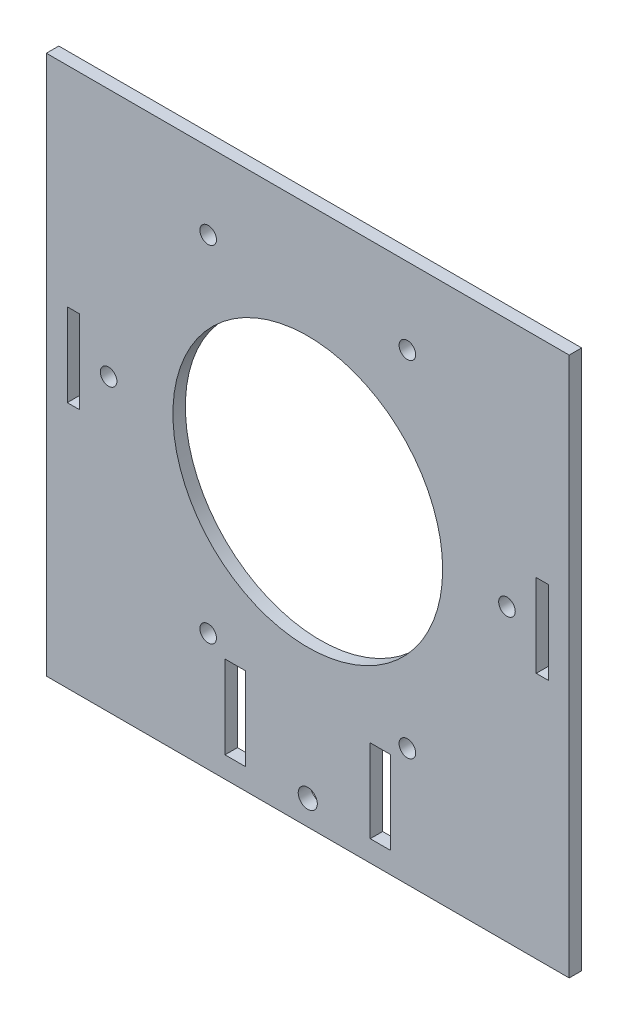
ISO-10303-21;
HEADER;
FILE_DESCRIPTION(('STEP AP214'),'2;1');
FILE_NAME('part.step','',(''),(''),'','','');
FILE_SCHEMA(('AUTOMOTIVE_DESIGN { 1 0 10303 214 1 1 1 1 }'));
ENDSEC;
DATA;
#1=APPLICATION_CONTEXT('core data for automotive mechanical design processes');
#2=APPLICATION_PROTOCOL_DEFINITION('international standard','automotive_design',2000,#1);
#3=PRODUCT_CONTEXT('',#1,'mechanical');
#4=PRODUCT('Part','Part','',(#3));
#5=PRODUCT_RELATED_PRODUCT_CATEGORY('part','',(#4));
#6=PRODUCT_DEFINITION_FORMATION('','',#4);
#7=PRODUCT_DEFINITION_CONTEXT('part definition',#1,'design');
#8=PRODUCT_DEFINITION('design','',#6,#7);
#9=PRODUCT_DEFINITION_SHAPE('','',#8);
#10=(LENGTH_UNIT() NAMED_UNIT(*) SI_UNIT(.MILLI.,.METRE.));
#11=(NAMED_UNIT(*) PLANE_ANGLE_UNIT() SI_UNIT($,.RADIAN.));
#12=(NAMED_UNIT(*) SI_UNIT($,.STERADIAN.) SOLID_ANGLE_UNIT());
#13=UNCERTAINTY_MEASURE_WITH_UNIT(LENGTH_MEASURE(1.E-05),#10,'distance_accuracy_value','');
#14=(GEOMETRIC_REPRESENTATION_CONTEXT(3) GLOBAL_UNCERTAINTY_ASSIGNED_CONTEXT((#13)) GLOBAL_UNIT_ASSIGNED_CONTEXT((#10,
#11,#12)) REPRESENTATION_CONTEXT('',''));
#15=CARTESIAN_POINT('',(0.,0.,0.));
#16=DIRECTION('',(0.,0.,1.));
#17=DIRECTION('',(1.,0.,0.));
#18=AXIS2_PLACEMENT_3D('',#15,#16,#17);
#19=CARTESIAN_POINT('',(0.,0.,3.));
#20=DIRECTION('',(0.,0.,1.));
#21=DIRECTION('',(1.,0.,0.));
#22=AXIS2_PLACEMENT_3D('',#19,#20,#21);
#23=PLANE('',#22);
#24=CARTESIAN_POINT('',(0.,-64.,3.));
#25=DIRECTION('',(0.,0.,1.));
#26=DIRECTION('',(1.,0.,0.));
#27=AXIS2_PLACEMENT_3D('',#24,#25,#26);
#28=CIRCLE('',#27,2.3);
#29=CARTESIAN_POINT('',(2.3,-64.,3.));
#30=VERTEX_POINT('',#29);
#31=EDGE_CURVE('E368',#30,#30,#28,.T.);
#32=ORIENTED_EDGE('',*,*,#31,.F.);
#33=EDGE_LOOP('',(#32));
#34=FACE_BOUND('',#33,.T.);
#35=CARTESIAN_POINT('',(-23.9999999999999,41.5692193816531,3.));
#36=DIRECTION('',(0.,0.,1.));
#37=DIRECTION('',(1.,0.,0.));
#38=AXIS2_PLACEMENT_3D('',#35,#36,#37);
#39=CIRCLE('',#38,2.);
#40=CARTESIAN_POINT('',(-21.9999999999999,41.5692193816531,3.));
#41=VERTEX_POINT('',#40);
#42=EDGE_CURVE('E364',#41,#41,#39,.T.);
#43=ORIENTED_EDGE('',*,*,#42,.F.);
#44=EDGE_LOOP('',(#43));
#45=FACE_BOUND('',#44,.T.);
#46=CARTESIAN_POINT('',(48.,0.,3.));
#47=DIRECTION('',(0.,0.,1.));
#48=DIRECTION('',(1.,0.,0.));
#49=AXIS2_PLACEMENT_3D('',#46,#47,#48);
#50=CIRCLE('',#49,2.);
#51=CARTESIAN_POINT('',(50.,0.,3.));
#52=VERTEX_POINT('',#51);
#53=EDGE_CURVE('E358',#52,#52,#50,.T.);
#54=ORIENTED_EDGE('',*,*,#53,.F.);
#55=EDGE_LOOP('',(#54));
#56=FACE_BOUND('',#55,.T.);
#57=CARTESIAN_POINT('',(24.0000000000002,41.569219381653,3.));
#58=DIRECTION('',(0.,0.,1.));
#59=DIRECTION('',(1.,0.,0.));
#60=AXIS2_PLACEMENT_3D('',#57,#58,#59);
#61=CIRCLE('',#60,2.);
#62=CARTESIAN_POINT('',(26.0000000000002,41.569219381653,3.));
#63=VERTEX_POINT('',#62);
#64=EDGE_CURVE('E352',#63,#63,#61,.T.);
#65=ORIENTED_EDGE('',*,*,#64,.F.);
#66=EDGE_LOOP('',(#65));
#67=FACE_BOUND('',#66,.T.);
#68=CARTESIAN_POINT('',(23.9999999999996,-41.5692193816533,3.));
#69=DIRECTION('',(0.,0.,1.));
#70=DIRECTION('',(1.,0.,0.));
#71=AXIS2_PLACEMENT_3D('',#68,#69,#70);
#72=CIRCLE('',#71,2.);
#73=CARTESIAN_POINT('',(25.9999999999996,-41.5692193816533,3.));
#74=VERTEX_POINT('',#73);
#75=EDGE_CURVE('E345',#74,#74,#72,.T.);
#76=ORIENTED_EDGE('',*,*,#75,.F.);
#77=EDGE_LOOP('',(#76));
#78=FACE_BOUND('',#77,.T.);
#79=CARTESIAN_POINT('',(-24.0000000000005,-41.5692193816528,3.));
#80=DIRECTION('',(0.,0.,1.));
#81=DIRECTION('',(1.,0.,0.));
#82=AXIS2_PLACEMENT_3D('',#79,#80,#81);
#83=CIRCLE('',#82,2.);
#84=CARTESIAN_POINT('',(-22.0000000000005,-41.5692193816528,3.));
#85=VERTEX_POINT('',#84);
#86=EDGE_CURVE('E336',#85,#85,#83,.T.);
#87=ORIENTED_EDGE('',*,*,#86,.F.);
#88=EDGE_LOOP('',(#87));
#89=FACE_BOUND('',#88,.T.);
#90=CARTESIAN_POINT('',(-48.,0.,3.));
#91=DIRECTION('',(0.,0.,1.));
#92=DIRECTION('',(1.,0.,0.));
#93=AXIS2_PLACEMENT_3D('',#90,#91,#92);
#94=CIRCLE('',#93,2.);
#95=CARTESIAN_POINT('',(-46.,0.,3.));
#96=VERTEX_POINT('',#95);
#97=EDGE_CURVE('E335',#96,#96,#94,.T.);
#98=ORIENTED_EDGE('',*,*,#97,.F.);
#99=EDGE_LOOP('',(#98));
#100=FACE_BOUND('',#99,.T.);
#101=DIRECTION('',(0.,-1.,0.));
#102=VECTOR('',#101,1.);
#103=CARTESIAN_POINT('',(15.05,-44.9,3.));
#104=LINE('',#103,#102);
#105=CARTESIAN_POINT('',(15.05,-44.9,3.));
#106=VERTEX_POINT('',#105);
#107=CARTESIAN_POINT('',(15.05,-64.9,3.));
#108=VERTEX_POINT('',#107);
#109=EDGE_CURVE('E243',#106,#108,#104,.T.);
#110=ORIENTED_EDGE('',*,*,#109,.F.);
#111=DIRECTION('',(-1.,0.,0.));
#112=VECTOR('',#111,1.);
#113=CARTESIAN_POINT('',(19.95,-44.9,3.));
#114=LINE('',#113,#112);
#115=CARTESIAN_POINT('',(19.95,-44.9,3.));
#116=VERTEX_POINT('',#115);
#117=EDGE_CURVE('E241',#116,#106,#114,.T.);
#118=ORIENTED_EDGE('',*,*,#117,.F.);
#119=DIRECTION('',(0.,1.,0.));
#120=VECTOR('',#119,1.);
#121=CARTESIAN_POINT('',(19.95,-44.9,3.));
#122=LINE('',#121,#120);
#123=CARTESIAN_POINT('',(19.95,-64.9,3.));
#124=VERTEX_POINT('',#123);
#125=EDGE_CURVE('E249',#124,#116,#122,.T.);
#126=ORIENTED_EDGE('',*,*,#125,.F.);
#127=DIRECTION('',(1.,0.,0.));
#128=VECTOR('',#127,1.);
#129=CARTESIAN_POINT('',(19.95,-64.9,3.));
#130=LINE('',#129,#128);
#131=EDGE_CURVE('E246',#108,#124,#130,.T.);
#132=ORIENTED_EDGE('',*,*,#131,.F.);
#133=EDGE_LOOP('',(#110,#118,#126,#132));
#134=FACE_BOUND('',#133,.T.);
#135=CARTESIAN_POINT('',(0.,0.,3.));
#136=DIRECTION('',(0.,0.,1.));
#137=DIRECTION('',(1.,0.,0.));
#138=AXIS2_PLACEMENT_3D('',#135,#136,#137);
#139=CIRCLE('',#138,32.5);
#140=CARTESIAN_POINT('',(32.5,0.,3.));
#141=VERTEX_POINT('',#140);
#142=EDGE_CURVE('E303',#141,#141,#139,.T.);
#143=ORIENTED_EDGE('',*,*,#142,.F.);
#144=EDGE_LOOP('',(#143));
#145=FACE_BOUND('',#144,.T.);
#146=DIRECTION('',(0.,-1.,0.));
#147=VECTOR('',#146,1.);
#148=CARTESIAN_POINT('',(-63.0000000000002,60.,3.));
#149=LINE('',#148,#147);
#150=CARTESIAN_POINT('',(-63.0000000000002,60.,3.));
#151=VERTEX_POINT('',#150);
#152=CARTESIAN_POINT('',(-63.0000000000002,-70.,3.));
#153=VERTEX_POINT('',#152);
#154=EDGE_CURVE('E309',#151,#153,#149,.T.);
#155=ORIENTED_EDGE('',*,*,#154,.T.);
#156=DIRECTION('',(1.,0.,0.));
#157=VECTOR('',#156,1.);
#158=CARTESIAN_POINT('',(-63.0000000000002,-70.,3.));
#159=LINE('',#158,#157);
#160=CARTESIAN_POINT('',(63.0000000000002,-70.,3.));
#161=VERTEX_POINT('',#160);
#162=EDGE_CURVE('E312',#153,#161,#159,.T.);
#163=ORIENTED_EDGE('',*,*,#162,.T.);
#164=DIRECTION('',(0.,1.,0.));
#165=VECTOR('',#164,1.);
#166=CARTESIAN_POINT('',(63.0000000000002,60.,3.));
#167=LINE('',#166,#165);
#168=CARTESIAN_POINT('',(63.0000000000002,60.,3.));
#169=VERTEX_POINT('',#168);
#170=EDGE_CURVE('E315',#161,#169,#167,.T.);
#171=ORIENTED_EDGE('',*,*,#170,.T.);
#172=DIRECTION('',(-1.,0.,0.));
#173=VECTOR('',#172,1.);
#174=CARTESIAN_POINT('',(-63.0000000000002,60.,3.));
#175=LINE('',#174,#173);
#176=EDGE_CURVE('E317',#169,#151,#175,.T.);
#177=ORIENTED_EDGE('',*,*,#176,.T.);
#178=EDGE_LOOP('',(#155,#163,#171,#177));
#179=FACE_BOUND('',#178,.T.);
#180=DIRECTION('',(-1.,0.,0.));
#181=VECTOR('',#180,1.);
#182=CARTESIAN_POINT('',(-15.05,-44.9,3.));
#183=LINE('',#182,#181);
#184=CARTESIAN_POINT('',(-15.05,-44.9,3.));
#185=VERTEX_POINT('',#184);
#186=CARTESIAN_POINT('',(-19.95,-44.9,3.));
#187=VERTEX_POINT('',#186);
#188=EDGE_CURVE('E274',#185,#187,#183,.T.);
#189=ORIENTED_EDGE('',*,*,#188,.F.);
#190=DIRECTION('',(0.,1.,0.));
#191=VECTOR('',#190,1.);
#192=CARTESIAN_POINT('',(-15.05,-44.9,3.));
#193=LINE('',#192,#191);
#194=CARTESIAN_POINT('',(-15.05,-64.9,3.));
#195=VERTEX_POINT('',#194);
#196=EDGE_CURVE('E272',#195,#185,#193,.T.);
#197=ORIENTED_EDGE('',*,*,#196,.F.);
#198=DIRECTION('',(1.,0.,0.));
#199=VECTOR('',#198,1.);
#200=CARTESIAN_POINT('',(-15.05,-64.9,3.));
#201=LINE('',#200,#199);
#202=CARTESIAN_POINT('',(-19.95,-64.9,3.));
#203=VERTEX_POINT('',#202);
#204=EDGE_CURVE('E280',#203,#195,#201,.T.);
#205=ORIENTED_EDGE('',*,*,#204,.F.);
#206=DIRECTION('',(0.,-1.,0.));
#207=VECTOR('',#206,1.);
#208=CARTESIAN_POINT('',(-19.95,-44.9,3.));
#209=LINE('',#208,#207);
#210=EDGE_CURVE('E277',#187,#203,#209,.T.);
#211=ORIENTED_EDGE('',*,*,#210,.F.);
#212=EDGE_LOOP('',(#189,#197,#205,#211));
#213=FACE_BOUND('',#212,.T.);
#214=DIRECTION('',(0.,-1.,0.));
#215=VECTOR('',#214,1.);
#216=CARTESIAN_POINT('',(-57.9500000000002,9.60000000000009,3.));
#217=LINE('',#216,#215);
#218=CARTESIAN_POINT('',(-57.9500000000002,9.60000000000009,3.));
#219=VERTEX_POINT('',#218);
#220=CARTESIAN_POINT('',(-57.9500000000002,-10.3999999999999,3.));
#221=VERTEX_POINT('',#220);
#222=EDGE_CURVE('E205',#219,#221,#217,.T.);
#223=ORIENTED_EDGE('',*,*,#222,.F.);
#224=DIRECTION('',(-1.,0.,0.));
#225=VECTOR('',#224,1.);
#226=CARTESIAN_POINT('',(-57.9500000000002,9.60000000000009,3.));
#227=LINE('',#226,#225);
#228=CARTESIAN_POINT('',(-55.0500000000002,9.60000000000009,3.));
#229=VERTEX_POINT('',#228);
#230=EDGE_CURVE('E213',#229,#219,#227,.T.);
#231=ORIENTED_EDGE('',*,*,#230,.F.);
#232=DIRECTION('',(0.,1.,0.));
#233=VECTOR('',#232,1.);
#234=CARTESIAN_POINT('',(-55.0500000000002,9.60000000000009,3.));
#235=LINE('',#234,#233);
#236=CARTESIAN_POINT('',(-55.0500000000002,-10.3999999999999,3.));
#237=VERTEX_POINT('',#236);
#238=EDGE_CURVE('E227',#237,#229,#235,.T.);
#239=ORIENTED_EDGE('',*,*,#238,.F.);
#240=DIRECTION('',(1.,0.,0.));
#241=VECTOR('',#240,1.);
#242=CARTESIAN_POINT('',(-57.9500000000002,-10.3999999999999,3.));
#243=LINE('',#242,#241);
#244=EDGE_CURVE('E224',#221,#237,#243,.T.);
#245=ORIENTED_EDGE('',*,*,#244,.F.);
#246=EDGE_LOOP('',(#223,#231,#239,#245));
#247=FACE_BOUND('',#246,.T.);
#248=DIRECTION('',(1.,0.,0.));
#249=VECTOR('',#248,1.);
#250=CARTESIAN_POINT('',(57.9500000000002,9.60000000000009,3.));
#251=LINE('',#250,#249);
#252=CARTESIAN_POINT('',(55.0500000000002,9.60000000000009,3.));
#253=VERTEX_POINT('',#252);
#254=CARTESIAN_POINT('',(57.9500000000002,9.60000000000009,3.));
#255=VERTEX_POINT('',#254);
#256=EDGE_CURVE('E199',#253,#255,#251,.T.);
#257=ORIENTED_EDGE('',*,*,#256,.T.);
#258=DIRECTION('',(0.,-1.,0.));
#259=VECTOR('',#258,1.);
#260=CARTESIAN_POINT('',(57.9500000000002,9.60000000000009,3.));
#261=LINE('',#260,#259);
#262=CARTESIAN_POINT('',(57.9500000000002,-10.3999999999999,3.));
#263=VERTEX_POINT('',#262);
#264=EDGE_CURVE('E49',#255,#263,#261,.T.);
#265=ORIENTED_EDGE('',*,*,#264,.T.);
#266=DIRECTION('',(-1.,0.,0.));
#267=VECTOR('',#266,1.);
#268=CARTESIAN_POINT('',(57.9500000000002,-10.3999999999999,3.));
#269=LINE('',#268,#267);
#270=CARTESIAN_POINT('',(55.0500000000002,-10.3999999999999,3.));
#271=VERTEX_POINT('',#270);
#272=EDGE_CURVE('E187',#263,#271,#269,.T.);
#273=ORIENTED_EDGE('',*,*,#272,.T.);
#274=DIRECTION('',(0.,1.,0.));
#275=VECTOR('',#274,1.);
#276=CARTESIAN_POINT('',(55.0500000000002,9.60000000000009,3.));
#277=LINE('',#276,#275);
#278=EDGE_CURVE('E190',#271,#253,#277,.T.);
#279=ORIENTED_EDGE('',*,*,#278,.T.);
#280=EDGE_LOOP('',(#257,#265,#273,#279));
#281=FACE_BOUND('',#280,.T.);
#282=ADVANCED_FACE('F32',(#34,#45,#56,#67,#78,#89,#100,#134,#145,#179,#213,#247,#281),#23,.T.);
#283=CARTESIAN_POINT('',(0.,0.,0.));
#284=DIRECTION('',(0.,0.,1.));
#285=DIRECTION('',(1.,0.,0.));
#286=AXIS2_PLACEMENT_3D('',#283,#284,#285);
#287=PLANE('',#286);
#288=CARTESIAN_POINT('',(0.,-64.,0.));
#289=DIRECTION('',(0.,0.,1.));
#290=DIRECTION('',(1.,0.,0.));
#291=AXIS2_PLACEMENT_3D('',#288,#289,#290);
#292=CIRCLE('',#291,2.3);
#293=CARTESIAN_POINT('',(2.3,-64.,0.));
#294=VERTEX_POINT('',#293);
#295=EDGE_CURVE('E367',#294,#294,#292,.T.);
#296=ORIENTED_EDGE('',*,*,#295,.T.);
#297=EDGE_LOOP('',(#296));
#298=FACE_BOUND('',#297,.T.);
#299=CARTESIAN_POINT('',(-23.9999999999999,41.5692193816531,0.));
#300=DIRECTION('',(0.,0.,1.));
#301=DIRECTION('',(1.,0.,0.));
#302=AXIS2_PLACEMENT_3D('',#299,#300,#301);
#303=CIRCLE('',#302,2.);
#304=CARTESIAN_POINT('',(-21.9999999999999,41.5692193816531,0.));
#305=VERTEX_POINT('',#304);
#306=EDGE_CURVE('E361',#305,#305,#303,.T.);
#307=ORIENTED_EDGE('',*,*,#306,.T.);
#308=EDGE_LOOP('',(#307));
#309=FACE_BOUND('',#308,.T.);
#310=CARTESIAN_POINT('',(48.,0.,0.));
#311=DIRECTION('',(0.,0.,1.));
#312=DIRECTION('',(1.,0.,0.));
#313=AXIS2_PLACEMENT_3D('',#310,#311,#312);
#314=CIRCLE('',#313,2.);
#315=CARTESIAN_POINT('',(50.,0.,0.));
#316=VERTEX_POINT('',#315);
#317=EDGE_CURVE('E355',#316,#316,#314,.T.);
#318=ORIENTED_EDGE('',*,*,#317,.T.);
#319=EDGE_LOOP('',(#318));
#320=FACE_BOUND('',#319,.T.);
#321=CARTESIAN_POINT('',(24.0000000000002,41.569219381653,0.));
#322=DIRECTION('',(0.,0.,1.));
#323=DIRECTION('',(1.,0.,0.));
#324=AXIS2_PLACEMENT_3D('',#321,#322,#323);
#325=CIRCLE('',#324,2.);
#326=CARTESIAN_POINT('',(26.0000000000002,41.569219381653,0.));
#327=VERTEX_POINT('',#326);
#328=EDGE_CURVE('E349',#327,#327,#325,.T.);
#329=ORIENTED_EDGE('',*,*,#328,.T.);
#330=EDGE_LOOP('',(#329));
#331=FACE_BOUND('',#330,.T.);
#332=CARTESIAN_POINT('',(23.9999999999996,-41.5692193816533,0.));
#333=DIRECTION('',(0.,0.,1.));
#334=DIRECTION('',(1.,0.,0.));
#335=AXIS2_PLACEMENT_3D('',#332,#333,#334);
#336=CIRCLE('',#335,2.);
#337=CARTESIAN_POINT('',(25.9999999999996,-41.5692193816533,0.));
#338=VERTEX_POINT('',#337);
#339=EDGE_CURVE('E36',#338,#338,#336,.T.);
#340=ORIENTED_EDGE('',*,*,#339,.T.);
#341=EDGE_LOOP('',(#340));
#342=FACE_BOUND('',#341,.T.);
#343=CARTESIAN_POINT('',(-24.0000000000005,-41.5692193816528,0.));
#344=DIRECTION('',(0.,0.,1.));
#345=DIRECTION('',(1.,0.,0.));
#346=AXIS2_PLACEMENT_3D('',#343,#344,#345);
#347=CIRCLE('',#346,2.);
#348=CARTESIAN_POINT('',(-22.0000000000005,-41.5692193816528,0.));
#349=VERTEX_POINT('',#348);
#350=EDGE_CURVE('E333',#349,#349,#347,.T.);
#351=ORIENTED_EDGE('',*,*,#350,.T.);
#352=EDGE_LOOP('',(#351));
#353=FACE_BOUND('',#352,.T.);
#354=CARTESIAN_POINT('',(-48.,0.,0.));
#355=DIRECTION('',(0.,0.,1.));
#356=DIRECTION('',(1.,0.,0.));
#357=AXIS2_PLACEMENT_3D('',#354,#355,#356);
#358=CIRCLE('',#357,2.);
#359=CARTESIAN_POINT('',(-46.,0.,0.));
#360=VERTEX_POINT('',#359);
#361=EDGE_CURVE('E193',#360,#360,#358,.T.);
#362=ORIENTED_EDGE('',*,*,#361,.T.);
#363=EDGE_LOOP('',(#362));
#364=FACE_BOUND('',#363,.T.);
#365=DIRECTION('',(-1.,0.,0.));
#366=VECTOR('',#365,1.);
#367=CARTESIAN_POINT('',(19.95,-44.9,0.));
#368=LINE('',#367,#366);
#369=CARTESIAN_POINT('',(19.95,-44.9,0.));
#370=VERTEX_POINT('',#369);
#371=CARTESIAN_POINT('',(15.05,-44.9,0.));
#372=VERTEX_POINT('',#371);
#373=EDGE_CURVE('E234',#370,#372,#368,.T.);
#374=ORIENTED_EDGE('',*,*,#373,.T.);
#375=DIRECTION('',(0.,-1.,0.));
#376=VECTOR('',#375,1.);
#377=CARTESIAN_POINT('',(15.05,-44.9,0.));
#378=LINE('',#377,#376);
#379=CARTESIAN_POINT('',(15.05,-64.9,0.));
#380=VERTEX_POINT('',#379);
#381=EDGE_CURVE('E254',#372,#380,#378,.T.);
#382=ORIENTED_EDGE('',*,*,#381,.T.);
#383=DIRECTION('',(1.,0.,0.));
#384=VECTOR('',#383,1.);
#385=CARTESIAN_POINT('',(19.95,-64.9,0.));
#386=LINE('',#385,#384);
#387=CARTESIAN_POINT('',(19.95,-64.9,0.));
#388=VERTEX_POINT('',#387);
#389=EDGE_CURVE('E257',#380,#388,#386,.T.);
#390=ORIENTED_EDGE('',*,*,#389,.T.);
#391=DIRECTION('',(0.,1.,0.));
#392=VECTOR('',#391,1.);
#393=CARTESIAN_POINT('',(19.95,-44.9,0.));
#394=LINE('',#393,#392);
#395=EDGE_CURVE('E244',#388,#370,#394,.T.);
#396=ORIENTED_EDGE('',*,*,#395,.T.);
#397=EDGE_LOOP('',(#374,#382,#390,#396));
#398=FACE_BOUND('',#397,.T.);
#399=CARTESIAN_POINT('',(0.,0.,0.));
#400=DIRECTION('',(0.,0.,1.));
#401=DIRECTION('',(1.,0.,0.));
#402=AXIS2_PLACEMENT_3D('',#399,#400,#401);
#403=CIRCLE('',#402,32.5);
#404=CARTESIAN_POINT('',(32.5,0.,0.));
#405=VERTEX_POINT('',#404);
#406=EDGE_CURVE('E302',#405,#405,#403,.T.);
#407=ORIENTED_EDGE('',*,*,#406,.T.);
#408=EDGE_LOOP('',(#407));
#409=FACE_BOUND('',#408,.T.);
#410=DIRECTION('',(0.,-1.,0.));
#411=VECTOR('',#410,1.);
#412=CARTESIAN_POINT('',(-63.0000000000002,60.,0.));
#413=LINE('',#412,#411);
#414=CARTESIAN_POINT('',(-63.0000000000002,60.,0.));
#415=VERTEX_POINT('',#414);
#416=CARTESIAN_POINT('',(-63.0000000000002,-70.,0.));
#417=VERTEX_POINT('',#416);
#418=EDGE_CURVE('E306',#415,#417,#413,.T.);
#419=ORIENTED_EDGE('',*,*,#418,.F.);
#420=DIRECTION('',(-1.,0.,0.));
#421=VECTOR('',#420,1.);
#422=CARTESIAN_POINT('',(-63.0000000000002,60.,0.));
#423=LINE('',#422,#421);
#424=CARTESIAN_POINT('',(63.0000000000002,60.,0.));
#425=VERTEX_POINT('',#424);
#426=EDGE_CURVE('E313',#425,#415,#423,.T.);
#427=ORIENTED_EDGE('',*,*,#426,.F.);
#428=DIRECTION('',(0.,1.,0.));
#429=VECTOR('',#428,1.);
#430=CARTESIAN_POINT('',(63.0000000000002,60.,0.));
#431=LINE('',#430,#429);
#432=CARTESIAN_POINT('',(63.0000000000002,-70.,0.));
#433=VERTEX_POINT('',#432);
#434=EDGE_CURVE('E324',#433,#425,#431,.T.);
#435=ORIENTED_EDGE('',*,*,#434,.F.);
#436=DIRECTION('',(1.,0.,0.));
#437=VECTOR('',#436,1.);
#438=CARTESIAN_POINT('',(-63.0000000000002,-70.,0.));
#439=LINE('',#438,#437);
#440=EDGE_CURVE('E322',#417,#433,#439,.T.);
#441=ORIENTED_EDGE('',*,*,#440,.F.);
#442=EDGE_LOOP('',(#419,#427,#435,#441));
#443=FACE_BOUND('',#442,.T.);
#444=DIRECTION('',(0.,1.,0.));
#445=VECTOR('',#444,1.);
#446=CARTESIAN_POINT('',(-15.05,-44.9,0.));
#447=LINE('',#446,#445);
#448=CARTESIAN_POINT('',(-15.05,-64.9,0.));
#449=VERTEX_POINT('',#448);
#450=CARTESIAN_POINT('',(-15.05,-44.9,0.));
#451=VERTEX_POINT('',#450);
#452=EDGE_CURVE('E271',#449,#451,#447,.T.);
#453=ORIENTED_EDGE('',*,*,#452,.T.);
#454=DIRECTION('',(-1.,0.,0.));
#455=VECTOR('',#454,1.);
#456=CARTESIAN_POINT('',(-15.05,-44.9,0.));
#457=LINE('',#456,#455);
#458=CARTESIAN_POINT('',(-19.95,-44.9,0.));
#459=VERTEX_POINT('',#458);
#460=EDGE_CURVE('E285',#451,#459,#457,.T.);
#461=ORIENTED_EDGE('',*,*,#460,.T.);
#462=DIRECTION('',(0.,-1.,0.));
#463=VECTOR('',#462,1.);
#464=CARTESIAN_POINT('',(-19.95,-44.9,0.));
#465=LINE('',#464,#463);
#466=CARTESIAN_POINT('',(-19.95,-64.9,0.));
#467=VERTEX_POINT('',#466);
#468=EDGE_CURVE('E288',#459,#467,#465,.T.);
#469=ORIENTED_EDGE('',*,*,#468,.T.);
#470=DIRECTION('',(1.,0.,0.));
#471=VECTOR('',#470,1.);
#472=CARTESIAN_POINT('',(-15.05,-64.9,0.));
#473=LINE('',#472,#471);
#474=EDGE_CURVE('E275',#467,#449,#473,.T.);
#475=ORIENTED_EDGE('',*,*,#474,.T.);
#476=EDGE_LOOP('',(#453,#461,#469,#475));
#477=FACE_BOUND('',#476,.T.);
#478=DIRECTION('',(-1.,0.,0.));
#479=VECTOR('',#478,1.);
#480=CARTESIAN_POINT('',(-57.9500000000002,9.60000000000009,0.));
#481=LINE('',#480,#479);
#482=CARTESIAN_POINT('',(-55.0500000000002,9.60000000000009,0.));
#483=VERTEX_POINT('',#482);
#484=CARTESIAN_POINT('',(-57.9500000000002,9.60000000000009,0.));
#485=VERTEX_POINT('',#484);
#486=EDGE_CURVE('E219',#483,#485,#481,.T.);
#487=ORIENTED_EDGE('',*,*,#486,.T.);
#488=DIRECTION('',(0.,-1.,0.));
#489=VECTOR('',#488,1.);
#490=CARTESIAN_POINT('',(-57.9500000000002,9.60000000000009,0.));
#491=LINE('',#490,#489);
#492=CARTESIAN_POINT('',(-57.9500000000002,-10.3999999999999,0.));
#493=VERTEX_POINT('',#492);
#494=EDGE_CURVE('E209',#485,#493,#491,.T.);
#495=ORIENTED_EDGE('',*,*,#494,.T.);
#496=DIRECTION('',(1.,0.,0.));
#497=VECTOR('',#496,1.);
#498=CARTESIAN_POINT('',(-57.9500000000002,-10.3999999999999,0.));
#499=LINE('',#498,#497);
#500=CARTESIAN_POINT('',(-55.0500000000002,-10.3999999999999,0.));
#501=VERTEX_POINT('',#500);
#502=EDGE_CURVE('E212',#493,#501,#499,.T.);
#503=ORIENTED_EDGE('',*,*,#502,.T.);
#504=DIRECTION('',(0.,1.,0.));
#505=VECTOR('',#504,1.);
#506=CARTESIAN_POINT('',(-55.0500000000002,9.60000000000009,0.));
#507=LINE('',#506,#505);
#508=EDGE_CURVE('E216',#501,#483,#507,.T.);
#509=ORIENTED_EDGE('',*,*,#508,.T.);
#510=EDGE_LOOP('',(#487,#495,#503,#509));
#511=FACE_BOUND('',#510,.T.);
#512=DIRECTION('',(0.,-1.,0.));
#513=VECTOR('',#512,1.);
#514=CARTESIAN_POINT('',(57.9500000000002,9.60000000000009,0.));
#515=LINE('',#514,#513);
#516=CARTESIAN_POINT('',(57.9500000000002,9.60000000000009,0.));
#517=VERTEX_POINT('',#516);
#518=CARTESIAN_POINT('',(57.9500000000002,-10.3999999999999,0.));
#519=VERTEX_POINT('',#518);
#520=EDGE_CURVE('E179',#517,#519,#515,.T.);
#521=ORIENTED_EDGE('',*,*,#520,.F.);
#522=DIRECTION('',(1.,0.,0.));
#523=VECTOR('',#522,1.);
#524=CARTESIAN_POINT('',(57.9500000000002,9.60000000000009,0.));
#525=LINE('',#524,#523);
#526=CARTESIAN_POINT('',(55.0500000000002,9.60000000000009,0.));
#527=VERTEX_POINT('',#526);
#528=EDGE_CURVE('E171',#527,#517,#525,.T.);
#529=ORIENTED_EDGE('',*,*,#528,.F.);
#530=DIRECTION('',(0.,1.,0.));
#531=VECTOR('',#530,1.);
#532=CARTESIAN_POINT('',(55.0500000000002,9.60000000000009,0.));
#533=LINE('',#532,#531);
#534=CARTESIAN_POINT('',(55.0500000000002,-10.3999999999999,0.));
#535=VERTEX_POINT('',#534);
#536=EDGE_CURVE('E178',#535,#527,#533,.T.);
#537=ORIENTED_EDGE('',*,*,#536,.F.);
#538=DIRECTION('',(-1.,0.,0.));
#539=VECTOR('',#538,1.);
#540=CARTESIAN_POINT('',(57.9500000000002,-10.3999999999999,0.));
#541=LINE('',#540,#539);
#542=EDGE_CURVE('E183',#519,#535,#541,.T.);
#543=ORIENTED_EDGE('',*,*,#542,.F.);
#544=EDGE_LOOP('',(#521,#529,#537,#543));
#545=FACE_BOUND('',#544,.T.);
#546=ADVANCED_FACE('F186',(#298,#309,#320,#331,#342,#353,#364,#398,#409,#443,#477,#511,#545),
#287,.F.);
#547=CARTESIAN_POINT('',(-63.0000000000002,60.,3.));
#548=DIRECTION('',(1.,0.,0.));
#549=DIRECTION('',(0.,1.,0.));
#550=AXIS2_PLACEMENT_3D('',#547,#548,#549);
#551=PLANE('',#550);
#552=ORIENTED_EDGE('',*,*,#418,.T.);
#553=DIRECTION('',(0.,0.,-1.));
#554=VECTOR('',#553,1.);
#555=CARTESIAN_POINT('',(-63.0000000000002,-70.,3.));
#556=LINE('',#555,#554);
#557=EDGE_CURVE('E11',#153,#417,#556,.T.);
#558=ORIENTED_EDGE('',*,*,#557,.F.);
#559=ORIENTED_EDGE('',*,*,#154,.F.);
#560=DIRECTION('',(0.,0.,-1.));
#561=VECTOR('',#560,1.);
#562=CARTESIAN_POINT('',(-63.0000000000002,60.,3.));
#563=LINE('',#562,#561);
#564=EDGE_CURVE('E319',#151,#415,#563,.T.);
#565=ORIENTED_EDGE('',*,*,#564,.T.);
#566=EDGE_LOOP('',(#552,#558,#559,#565));
#567=FACE_BOUND('',#566,.T.);
#568=ADVANCED_FACE('F34',(#567),#551,.F.);
#569=CARTESIAN_POINT('',(-63.0000000000002,-70.,3.));
#570=DIRECTION('',(0.,1.,0.));
#571=DIRECTION('',(0.,0.,1.));
#572=AXIS2_PLACEMENT_3D('',#569,#570,#571);
#573=PLANE('',#572);
#574=ORIENTED_EDGE('',*,*,#440,.T.);
#575=DIRECTION('',(0.,0.,-1.));
#576=VECTOR('',#575,1.);
#577=CARTESIAN_POINT('',(63.0000000000002,-70.,3.));
#578=LINE('',#577,#576);
#579=EDGE_CURVE('E41',#161,#433,#578,.T.);
#580=ORIENTED_EDGE('',*,*,#579,.F.);
#581=ORIENTED_EDGE('',*,*,#162,.F.);
#582=ORIENTED_EDGE('',*,*,#557,.T.);
#583=EDGE_LOOP('',(#574,#580,#581,#582));
#584=FACE_BOUND('',#583,.T.);
#585=ADVANCED_FACE('F494',(#584),#573,.F.);
#586=CARTESIAN_POINT('',(63.0000000000002,60.,3.));
#587=DIRECTION('',(-1.,0.,0.));
#588=DIRECTION('',(0.,0.,1.));
#589=AXIS2_PLACEMENT_3D('',#586,#587,#588);
#590=PLANE('',#589);
#591=ORIENTED_EDGE('',*,*,#434,.T.);
#592=DIRECTION('',(0.,0.,-1.));
#593=VECTOR('',#592,1.);
#594=CARTESIAN_POINT('',(63.0000000000002,60.,3.));
#595=LINE('',#594,#593);
#596=EDGE_CURVE('E329',#169,#425,#595,.T.);
#597=ORIENTED_EDGE('',*,*,#596,.F.);
#598=ORIENTED_EDGE('',*,*,#170,.F.);
#599=ORIENTED_EDGE('',*,*,#579,.T.);
#600=EDGE_LOOP('',(#591,#597,#598,#599));
#601=FACE_BOUND('',#600,.T.);
#602=ADVANCED_FACE('F491',(#601),#590,.F.);
#603=CARTESIAN_POINT('',(-63.0000000000002,60.,3.));
#604=DIRECTION('',(0.,-1.,0.));
#605=DIRECTION('',(0.,0.,-1.));
#606=AXIS2_PLACEMENT_3D('',#603,#604,#605);
#607=PLANE('',#606);
#608=ORIENTED_EDGE('',*,*,#426,.T.);
#609=ORIENTED_EDGE('',*,*,#564,.F.);
#610=ORIENTED_EDGE('',*,*,#176,.F.);
#611=ORIENTED_EDGE('',*,*,#596,.T.);
#612=EDGE_LOOP('',(#608,#609,#610,#611));
#613=FACE_BOUND('',#612,.T.);
#614=ADVANCED_FACE('F484',(#613),#607,.F.);
#615=CARTESIAN_POINT('',(0.,0.,3.));
#616=DIRECTION('',(0.,0.,-1.));
#617=DIRECTION('',(-1.,0.,0.));
#618=AXIS2_PLACEMENT_3D('',#615,#616,#617);
#619=CYLINDRICAL_SURFACE('',#618,32.5);
#620=ORIENTED_EDGE('',*,*,#142,.T.);
#621=EDGE_LOOP('',(#620));
#622=FACE_BOUND('',#621,.T.);
#623=ORIENTED_EDGE('',*,*,#406,.F.);
#624=EDGE_LOOP('',(#623));
#625=FACE_BOUND('',#624,.T.);
#626=ADVANCED_FACE('F481',(#622,#625),#619,.F.);
#627=CARTESIAN_POINT('',(-15.05,-44.9,3.));
#628=DIRECTION('',(-1.,0.,0.));
#629=DIRECTION('',(0.,-1.,0.));
#630=AXIS2_PLACEMENT_3D('',#627,#628,#629);
#631=PLANE('',#630);
#632=ORIENTED_EDGE('',*,*,#452,.F.);
#633=DIRECTION('',(0.,0.,-1.));
#634=VECTOR('',#633,1.);
#635=CARTESIAN_POINT('',(-15.05,-64.9,3.));
#636=LINE('',#635,#634);
#637=EDGE_CURVE('E282',#195,#449,#636,.T.);
#638=ORIENTED_EDGE('',*,*,#637,.F.);
#639=ORIENTED_EDGE('',*,*,#196,.T.);
#640=DIRECTION('',(0.,0.,-1.));
#641=VECTOR('',#640,1.);
#642=CARTESIAN_POINT('',(-15.05,-44.9,3.));
#643=LINE('',#642,#641);
#644=EDGE_CURVE('E299',#185,#451,#643,.T.);
#645=ORIENTED_EDGE('',*,*,#644,.T.);
#646=EDGE_LOOP('',(#632,#638,#639,#645));
#647=FACE_BOUND('',#646,.T.);
#648=ADVANCED_FACE('F477',(#647),#631,.T.);
#649=CARTESIAN_POINT('',(-15.05,-44.9,3.));
#650=DIRECTION('',(0.,-1.,0.));
#651=DIRECTION('',(0.,0.,-1.));
#652=AXIS2_PLACEMENT_3D('',#649,#650,#651);
#653=PLANE('',#652);
#654=ORIENTED_EDGE('',*,*,#460,.F.);
#655=ORIENTED_EDGE('',*,*,#644,.F.);
#656=ORIENTED_EDGE('',*,*,#188,.T.);
#657=DIRECTION('',(0.,0.,-1.));
#658=VECTOR('',#657,1.);
#659=CARTESIAN_POINT('',(-19.95,-44.9,3.));
#660=LINE('',#659,#658);
#661=EDGE_CURVE('E297',#187,#459,#660,.T.);
#662=ORIENTED_EDGE('',*,*,#661,.T.);
#663=EDGE_LOOP('',(#654,#655,#656,#662));
#664=FACE_BOUND('',#663,.T.);
#665=ADVANCED_FACE('F473',(#664),#653,.T.);
#666=CARTESIAN_POINT('',(-19.95,-44.9,3.));
#667=DIRECTION('',(1.,0.,0.));
#668=DIRECTION('',(0.,0.,-1.));
#669=AXIS2_PLACEMENT_3D('',#666,#667,#668);
#670=PLANE('',#669);
#671=ORIENTED_EDGE('',*,*,#468,.F.);
#672=ORIENTED_EDGE('',*,*,#661,.F.);
#673=ORIENTED_EDGE('',*,*,#210,.T.);
#674=DIRECTION('',(0.,0.,-1.));
#675=VECTOR('',#674,1.);
#676=CARTESIAN_POINT('',(-19.95,-64.9,3.));
#677=LINE('',#676,#675);
#678=EDGE_CURVE('E295',#203,#467,#677,.T.);
#679=ORIENTED_EDGE('',*,*,#678,.T.);
#680=EDGE_LOOP('',(#671,#672,#673,#679));
#681=FACE_BOUND('',#680,.T.);
#682=ADVANCED_FACE('F469',(#681),#670,.T.);
#683=CARTESIAN_POINT('',(-15.05,-64.9,3.));
#684=DIRECTION('',(0.,1.,0.));
#685=DIRECTION('',(0.,0.,1.));
#686=AXIS2_PLACEMENT_3D('',#683,#684,#685);
#687=PLANE('',#686);
#688=ORIENTED_EDGE('',*,*,#474,.F.);
#689=ORIENTED_EDGE('',*,*,#678,.F.);
#690=ORIENTED_EDGE('',*,*,#204,.T.);
#691=ORIENTED_EDGE('',*,*,#637,.T.);
#692=EDGE_LOOP('',(#688,#689,#690,#691));
#693=FACE_BOUND('',#692,.T.);
#694=ADVANCED_FACE('F465',(#693),#687,.T.);
#695=CARTESIAN_POINT('',(19.95,-44.9,3.));
#696=DIRECTION('',(0.,-1.,0.));
#697=DIRECTION('',(0.,0.,-1.));
#698=AXIS2_PLACEMENT_3D('',#695,#696,#697);
#699=PLANE('',#698);
#700=ORIENTED_EDGE('',*,*,#373,.F.);
#701=DIRECTION('',(0.,0.,-1.));
#702=VECTOR('',#701,1.);
#703=CARTESIAN_POINT('',(19.95,-44.9,3.));
#704=LINE('',#703,#702);
#705=EDGE_CURVE('E251',#116,#370,#704,.T.);
#706=ORIENTED_EDGE('',*,*,#705,.F.);
#707=ORIENTED_EDGE('',*,*,#117,.T.);
#708=DIRECTION('',(0.,0.,-1.));
#709=VECTOR('',#708,1.);
#710=CARTESIAN_POINT('',(15.05,-44.9,3.));
#711=LINE('',#710,#709);
#712=EDGE_CURVE('E268',#106,#372,#711,.T.);
#713=ORIENTED_EDGE('',*,*,#712,.T.);
#714=EDGE_LOOP('',(#700,#706,#707,#713));
#715=FACE_BOUND('',#714,.T.);
#716=ADVANCED_FACE('F461',(#715),#699,.T.);
#717=CARTESIAN_POINT('',(15.05,-44.9,3.));
#718=DIRECTION('',(1.,0.,0.));
#719=DIRECTION('',(0.,1.,0.));
#720=AXIS2_PLACEMENT_3D('',#717,#718,#719);
#721=PLANE('',#720);
#722=ORIENTED_EDGE('',*,*,#381,.F.);
#723=ORIENTED_EDGE('',*,*,#712,.F.);
#724=ORIENTED_EDGE('',*,*,#109,.T.);
#725=DIRECTION('',(0.,0.,-1.));
#726=VECTOR('',#725,1.);
#727=CARTESIAN_POINT('',(15.05,-64.9,3.));
#728=LINE('',#727,#726);
#729=EDGE_CURVE('E266',#108,#380,#728,.T.);
#730=ORIENTED_EDGE('',*,*,#729,.T.);
#731=EDGE_LOOP('',(#722,#723,#724,#730));
#732=FACE_BOUND('',#731,.T.);
#733=ADVANCED_FACE('F457',(#732),#721,.T.);
#734=CARTESIAN_POINT('',(19.95,-64.9,3.));
#735=DIRECTION('',(0.,1.,0.));
#736=DIRECTION('',(0.,0.,1.));
#737=AXIS2_PLACEMENT_3D('',#734,#735,#736);
#738=PLANE('',#737);
#739=ORIENTED_EDGE('',*,*,#389,.F.);
#740=ORIENTED_EDGE('',*,*,#729,.F.);
#741=ORIENTED_EDGE('',*,*,#131,.T.);
#742=DIRECTION('',(0.,0.,-1.));
#743=VECTOR('',#742,1.);
#744=CARTESIAN_POINT('',(19.95,-64.9,3.));
#745=LINE('',#744,#743);
#746=EDGE_CURVE('E264',#124,#388,#745,.T.);
#747=ORIENTED_EDGE('',*,*,#746,.T.);
#748=EDGE_LOOP('',(#739,#740,#741,#747));
#749=FACE_BOUND('',#748,.T.);
#750=ADVANCED_FACE('F453',(#749),#738,.T.);
#751=CARTESIAN_POINT('',(19.95,-44.9,3.));
#752=DIRECTION('',(-1.,0.,0.));
#753=DIRECTION('',(0.,-1.,0.));
#754=AXIS2_PLACEMENT_3D('',#751,#752,#753);
#755=PLANE('',#754);
#756=ORIENTED_EDGE('',*,*,#395,.F.);
#757=ORIENTED_EDGE('',*,*,#746,.F.);
#758=ORIENTED_EDGE('',*,*,#125,.T.);
#759=ORIENTED_EDGE('',*,*,#705,.T.);
#760=EDGE_LOOP('',(#756,#757,#758,#759));
#761=FACE_BOUND('',#760,.T.);
#762=ADVANCED_FACE('F449',(#761),#755,.T.);
#763=CARTESIAN_POINT('',(-57.9500000000002,9.60000000000009,0.));
#764=DIRECTION('',(-1.,0.,0.));
#765=DIRECTION('',(0.,0.,1.));
#766=AXIS2_PLACEMENT_3D('',#763,#764,#765);
#767=PLANE('',#766);
#768=ORIENTED_EDGE('',*,*,#222,.T.);
#769=DIRECTION('',(0.,0.,1.));
#770=VECTOR('',#769,1.);
#771=CARTESIAN_POINT('',(-57.9500000000002,-10.3999999999999,0.));
#772=LINE('',#771,#770);
#773=EDGE_CURVE('E222',#493,#221,#772,.T.);
#774=ORIENTED_EDGE('',*,*,#773,.F.);
#775=ORIENTED_EDGE('',*,*,#494,.F.);
#776=DIRECTION('',(0.,0.,1.));
#777=VECTOR('',#776,1.);
#778=CARTESIAN_POINT('',(-57.9500000000002,9.60000000000009,0.));
#779=LINE('',#778,#777);
#780=EDGE_CURVE('E232',#485,#219,#779,.T.);
#781=ORIENTED_EDGE('',*,*,#780,.T.);
#782=EDGE_LOOP('',(#768,#774,#775,#781));
#783=FACE_BOUND('',#782,.T.);
#784=ADVANCED_FACE('F439',(#783),#767,.F.);
#785=CARTESIAN_POINT('',(-57.9500000000002,9.60000000000009,0.));
#786=DIRECTION('',(0.,1.,0.));
#787=DIRECTION('',(0.,0.,1.));
#788=AXIS2_PLACEMENT_3D('',#785,#786,#787);
#789=PLANE('',#788);
#790=ORIENTED_EDGE('',*,*,#230,.T.);
#791=ORIENTED_EDGE('',*,*,#780,.F.);
#792=ORIENTED_EDGE('',*,*,#486,.F.);
#793=DIRECTION('',(0.,0.,1.));
#794=VECTOR('',#793,1.);
#795=CARTESIAN_POINT('',(-55.0500000000002,9.60000000000009,0.));
#796=LINE('',#795,#794);
#797=EDGE_CURVE('E235',#483,#229,#796,.T.);
#798=ORIENTED_EDGE('',*,*,#797,.T.);
#799=EDGE_LOOP('',(#790,#791,#792,#798));
#800=FACE_BOUND('',#799,.T.);
#801=ADVANCED_FACE('F435',(#800),#789,.F.);
#802=CARTESIAN_POINT('',(-55.0500000000002,9.60000000000009,0.));
#803=DIRECTION('',(1.,0.,0.));
#804=DIRECTION('',(0.,1.,0.));
#805=AXIS2_PLACEMENT_3D('',#802,#803,#804);
#806=PLANE('',#805);
#807=ORIENTED_EDGE('',*,*,#238,.T.);
#808=ORIENTED_EDGE('',*,*,#797,.F.);
#809=ORIENTED_EDGE('',*,*,#508,.F.);
#810=DIRECTION('',(0.,0.,1.));
#811=VECTOR('',#810,1.);
#812=CARTESIAN_POINT('',(-55.0500000000002,-10.3999999999999,0.));
#813=LINE('',#812,#811);
#814=EDGE_CURVE('E237',#501,#237,#813,.T.);
#815=ORIENTED_EDGE('',*,*,#814,.T.);
#816=EDGE_LOOP('',(#807,#808,#809,#815));
#817=FACE_BOUND('',#816,.T.);
#818=ADVANCED_FACE('F438',(#817),#806,.F.);
#819=CARTESIAN_POINT('',(-57.9500000000002,-10.3999999999999,0.));
#820=DIRECTION('',(0.,-1.,0.));
#821=DIRECTION('',(0.,0.,-1.));
#822=AXIS2_PLACEMENT_3D('',#819,#820,#821);
#823=PLANE('',#822);
#824=ORIENTED_EDGE('',*,*,#244,.T.);
#825=ORIENTED_EDGE('',*,*,#814,.F.);
#826=ORIENTED_EDGE('',*,*,#502,.F.);
#827=ORIENTED_EDGE('',*,*,#773,.T.);
#828=EDGE_LOOP('',(#824,#825,#826,#827));
#829=FACE_BOUND('',#828,.T.);
#830=ADVANCED_FACE('F427',(#829),#823,.F.);
#831=CARTESIAN_POINT('',(57.9500000000002,9.60000000000009,0.));
#832=DIRECTION('',(-1.,0.,0.));
#833=DIRECTION('',(0.,0.,1.));
#834=AXIS2_PLACEMENT_3D('',#831,#832,#833);
#835=PLANE('',#834);
#836=ORIENTED_EDGE('',*,*,#264,.F.);
#837=DIRECTION('',(0.,0.,1.));
#838=VECTOR('',#837,1.);
#839=CARTESIAN_POINT('',(57.9500000000002,9.60000000000009,0.));
#840=LINE('',#839,#838);
#841=EDGE_CURVE('E173',#517,#255,#840,.T.);
#842=ORIENTED_EDGE('',*,*,#841,.F.);
#843=ORIENTED_EDGE('',*,*,#520,.T.);
#844=DIRECTION('',(0.,0.,1.));
#845=VECTOR('',#844,1.);
#846=CARTESIAN_POINT('',(57.9500000000002,-10.3999999999999,0.));
#847=LINE('',#846,#845);
#848=EDGE_CURVE('E203',#519,#263,#847,.T.);
#849=ORIENTED_EDGE('',*,*,#848,.T.);
#850=EDGE_LOOP('',(#836,#842,#843,#849));
#851=FACE_BOUND('',#850,.T.);
#852=ADVANCED_FACE('F181',(#851),#835,.T.);
#853=CARTESIAN_POINT('',(57.9500000000002,-10.3999999999999,0.));
#854=DIRECTION('',(0.,1.,0.));
#855=DIRECTION('',(0.,0.,1.));
#856=AXIS2_PLACEMENT_3D('',#853,#854,#855);
#857=PLANE('',#856);
#858=ORIENTED_EDGE('',*,*,#272,.F.);
#859=ORIENTED_EDGE('',*,*,#848,.F.);
#860=ORIENTED_EDGE('',*,*,#542,.T.);
#861=DIRECTION('',(0.,0.,1.));
#862=VECTOR('',#861,1.);
#863=CARTESIAN_POINT('',(55.0500000000002,-10.3999999999999,0.));
#864=LINE('',#863,#862);
#865=EDGE_CURVE('E206',#535,#271,#864,.T.);
#866=ORIENTED_EDGE('',*,*,#865,.T.);
#867=EDGE_LOOP('',(#858,#859,#860,#866));
#868=FACE_BOUND('',#867,.T.);
#869=ADVANCED_FACE('F419',(#868),#857,.T.);
#870=CARTESIAN_POINT('',(55.0500000000002,9.60000000000009,0.));
#871=DIRECTION('',(1.,0.,0.));
#872=DIRECTION('',(0.,1.,0.));
#873=AXIS2_PLACEMENT_3D('',#870,#871,#872);
#874=PLANE('',#873);
#875=ORIENTED_EDGE('',*,*,#278,.F.);
#876=ORIENTED_EDGE('',*,*,#865,.F.);
#877=ORIENTED_EDGE('',*,*,#536,.T.);
#878=DIRECTION('',(0.,0.,1.));
#879=VECTOR('',#878,1.);
#880=CARTESIAN_POINT('',(55.0500000000002,9.60000000000009,0.));
#881=LINE('',#880,#879);
#882=EDGE_CURVE('E57',#527,#253,#881,.T.);
#883=ORIENTED_EDGE('',*,*,#882,.T.);
#884=EDGE_LOOP('',(#875,#876,#877,#883));
#885=FACE_BOUND('',#884,.T.);
#886=ADVANCED_FACE('F417',(#885),#874,.T.);
#887=CARTESIAN_POINT('',(57.9500000000002,9.60000000000009,0.));
#888=DIRECTION('',(0.,-1.,0.));
#889=DIRECTION('',(0.,0.,-1.));
#890=AXIS2_PLACEMENT_3D('',#887,#888,#889);
#891=PLANE('',#890);
#892=ORIENTED_EDGE('',*,*,#256,.F.);
#893=ORIENTED_EDGE('',*,*,#882,.F.);
#894=ORIENTED_EDGE('',*,*,#528,.T.);
#895=ORIENTED_EDGE('',*,*,#841,.T.);
#896=EDGE_LOOP('',(#892,#893,#894,#895));
#897=FACE_BOUND('',#896,.T.);
#898=ADVANCED_FACE('F172',(#897),#891,.T.);
#899=CARTESIAN_POINT('',(-48.,0.,3.));
#900=DIRECTION('',(0.,0.,1.));
#901=DIRECTION('',(1.,0.,0.));
#902=AXIS2_PLACEMENT_3D('',#899,#900,#901);
#903=CYLINDRICAL_SURFACE('',#902,2.);
#904=ORIENTED_EDGE('',*,*,#97,.T.);
#905=EDGE_LOOP('',(#904));
#906=FACE_BOUND('',#905,.T.);
#907=ORIENTED_EDGE('',*,*,#361,.F.);
#908=EDGE_LOOP('',(#907));
#909=FACE_BOUND('',#908,.T.);
#910=ADVANCED_FACE('F430',(#906,#909),#903,.F.);
#911=CARTESIAN_POINT('',(-24.0000000000005,-41.5692193816528,3.));
#912=DIRECTION('',(0.,0.,1.));
#913=DIRECTION('',(1.,0.,0.));
#914=AXIS2_PLACEMENT_3D('',#911,#912,#913);
#915=CYLINDRICAL_SURFACE('',#914,2.);
#916=ORIENTED_EDGE('',*,*,#86,.T.);
#917=EDGE_LOOP('',(#916));
#918=FACE_BOUND('',#917,.T.);
#919=ORIENTED_EDGE('',*,*,#350,.F.);
#920=EDGE_LOOP('',(#919));
#921=FACE_BOUND('',#920,.T.);
#922=ADVANCED_FACE('F576',(#918,#921),#915,.F.);
#923=CARTESIAN_POINT('',(23.9999999999996,-41.5692193816533,3.));
#924=DIRECTION('',(0.,0.,1.));
#925=DIRECTION('',(1.,0.,0.));
#926=AXIS2_PLACEMENT_3D('',#923,#924,#925);
#927=CYLINDRICAL_SURFACE('',#926,2.);
#928=ORIENTED_EDGE('',*,*,#75,.T.);
#929=EDGE_LOOP('',(#928));
#930=FACE_BOUND('',#929,.T.);
#931=ORIENTED_EDGE('',*,*,#339,.F.);
#932=EDGE_LOOP('',(#931));
#933=FACE_BOUND('',#932,.T.);
#934=ADVANCED_FACE('F566',(#930,#933),#927,.F.);
#935=CARTESIAN_POINT('',(24.0000000000002,41.569219381653,3.));
#936=DIRECTION('',(0.,0.,1.));
#937=DIRECTION('',(1.,0.,0.));
#938=AXIS2_PLACEMENT_3D('',#935,#936,#937);
#939=CYLINDRICAL_SURFACE('',#938,2.);
#940=ORIENTED_EDGE('',*,*,#64,.T.);
#941=EDGE_LOOP('',(#940));
#942=FACE_BOUND('',#941,.T.);
#943=ORIENTED_EDGE('',*,*,#328,.F.);
#944=EDGE_LOOP('',(#943));
#945=FACE_BOUND('',#944,.T.);
#946=ADVANCED_FACE('F556',(#942,#945),#939,.F.);
#947=CARTESIAN_POINT('',(48.,0.,3.));
#948=DIRECTION('',(0.,0.,1.));
#949=DIRECTION('',(1.,0.,0.));
#950=AXIS2_PLACEMENT_3D('',#947,#948,#949);
#951=CYLINDRICAL_SURFACE('',#950,2.);
#952=ORIENTED_EDGE('',*,*,#53,.T.);
#953=EDGE_LOOP('',(#952));
#954=FACE_BOUND('',#953,.T.);
#955=ORIENTED_EDGE('',*,*,#317,.F.);
#956=EDGE_LOOP('',(#955));
#957=FACE_BOUND('',#956,.T.);
#958=ADVANCED_FACE('F545',(#954,#957),#951,.F.);
#959=CARTESIAN_POINT('',(-23.9999999999999,41.5692193816531,3.));
#960=DIRECTION('',(0.,0.,1.));
#961=DIRECTION('',(1.,0.,0.));
#962=AXIS2_PLACEMENT_3D('',#959,#960,#961);
#963=CYLINDRICAL_SURFACE('',#962,2.);
#964=ORIENTED_EDGE('',*,*,#42,.T.);
#965=EDGE_LOOP('',(#964));
#966=FACE_BOUND('',#965,.T.);
#967=ORIENTED_EDGE('',*,*,#306,.F.);
#968=EDGE_LOOP('',(#967));
#969=FACE_BOUND('',#968,.T.);
#970=ADVANCED_FACE('F379',(#966,#969),#963,.F.);
#971=CARTESIAN_POINT('',(0.,-64.,0.));
#972=DIRECTION('',(0.,0.,1.));
#973=DIRECTION('',(1.,0.,0.));
#974=AXIS2_PLACEMENT_3D('',#971,#972,#973);
#975=CYLINDRICAL_SURFACE('',#974,2.3);
#976=ORIENTED_EDGE('',*,*,#295,.F.);
#977=EDGE_LOOP('',(#976));
#978=FACE_BOUND('',#977,.T.);
#979=ORIENTED_EDGE('',*,*,#31,.T.);
#980=EDGE_LOOP('',(#979));
#981=FACE_BOUND('',#980,.T.);
#982=ADVANCED_FACE('F376',(#978,#981),#975,.F.);
#983=CLOSED_SHELL('',(#282,#546,#568,#585,#602,#614,#626,#648,#665,#682,#694,#716,#733,#750,
#762,#784,#801,#818,#830,#852,#869,#886,#898,#910,#922,#934,#946,#958,#970,#982));
#984=MANIFOLD_SOLID_BREP('B2',#983);
#985=ADVANCED_BREP_SHAPE_REPRESENTATION('',(#18,#984),#14);
#986=SHAPE_DEFINITION_REPRESENTATION(#9,#985);
ENDSEC;
END-ISO-10303-21;
